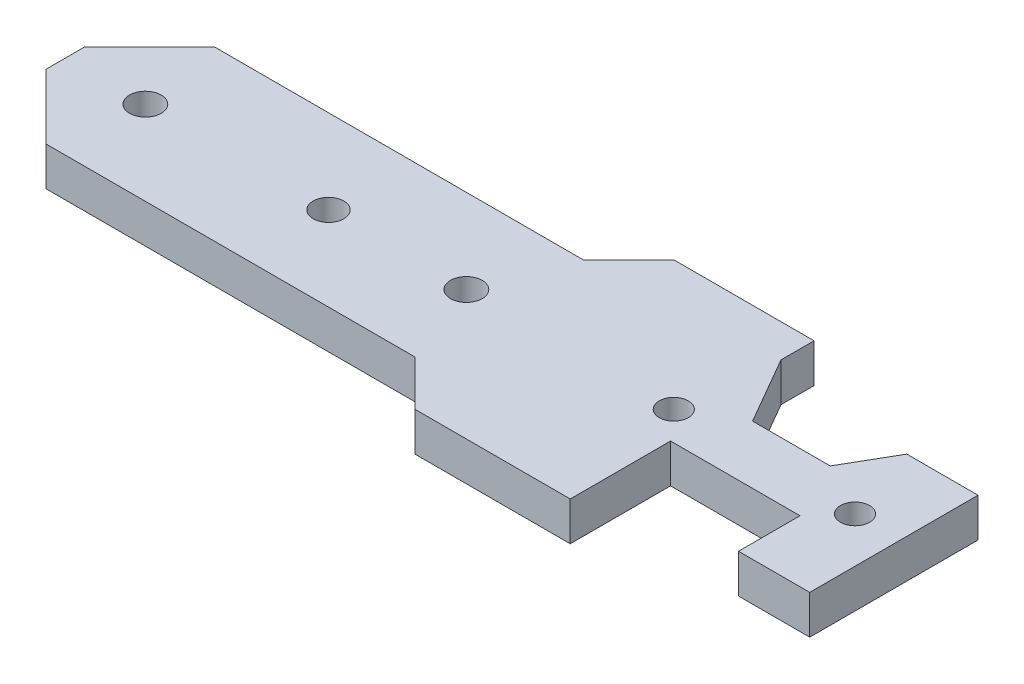
ISO-10303-21;
HEADER;
FILE_DESCRIPTION(('STEP AP214'),'2;1');
FILE_NAME('part.step','',(''),(''),'','','');
FILE_SCHEMA(('AUTOMOTIVE_DESIGN { 1 0 10303 214 1 1 1 1 }'));
ENDSEC;
DATA;
#1=APPLICATION_CONTEXT('core data for automotive mechanical design processes');
#2=APPLICATION_PROTOCOL_DEFINITION('international standard','automotive_design',2000,#1);
#3=PRODUCT_CONTEXT('',#1,'mechanical');
#4=PRODUCT('Part','Part','',(#3));
#5=PRODUCT_RELATED_PRODUCT_CATEGORY('part','',(#4));
#6=PRODUCT_DEFINITION_FORMATION('','',#4);
#7=PRODUCT_DEFINITION_CONTEXT('part definition',#1,'design');
#8=PRODUCT_DEFINITION('design','',#6,#7);
#9=PRODUCT_DEFINITION_SHAPE('','',#8);
#10=(LENGTH_UNIT() NAMED_UNIT(*) SI_UNIT(.MILLI.,.METRE.));
#11=(NAMED_UNIT(*) PLANE_ANGLE_UNIT() SI_UNIT($,.RADIAN.));
#12=(NAMED_UNIT(*) SI_UNIT($,.STERADIAN.) SOLID_ANGLE_UNIT());
#13=UNCERTAINTY_MEASURE_WITH_UNIT(LENGTH_MEASURE(1.E-05),#10,'distance_accuracy_value','');
#14=(GEOMETRIC_REPRESENTATION_CONTEXT(3) GLOBAL_UNCERTAINTY_ASSIGNED_CONTEXT((#13)) GLOBAL_UNIT_ASSIGNED_CONTEXT((#10,
#11,#12)) REPRESENTATION_CONTEXT('',''));
#15=CARTESIAN_POINT('',(0.,0.,0.));
#16=DIRECTION('',(0.,0.,1.));
#17=DIRECTION('',(1.,0.,0.));
#18=AXIS2_PLACEMENT_3D('',#15,#16,#17);
#19=CARTESIAN_POINT('',(67.,6.,13.));
#20=DIRECTION('',(0.707106781186547,0.,-0.707106781186548));
#21=DIRECTION('',(-0.707106781186548,0.,-0.707106781186547));
#22=AXIS2_PLACEMENT_3D('',#19,#20,#21);
#23=PLANE('',#22);
#24=DIRECTION('',(0.707106781186548,0.,0.707106781186547));
#25=VECTOR('',#24,1.);
#26=CARTESIAN_POINT('',(67.,0.,13.));
#27=LINE('',#26,#25);
#28=CARTESIAN_POINT('',(67.,0.,13.));
#29=VERTEX_POINT('',#28);
#30=CARTESIAN_POINT('',(74.,0.,20.));
#31=VERTEX_POINT('',#30);
#32=EDGE_CURVE('E292',#29,#31,#27,.T.);
#33=ORIENTED_EDGE('',*,*,#32,.T.);
#34=DIRECTION('',(0.,-1.,0.));
#35=VECTOR('',#34,1.);
#36=CARTESIAN_POINT('',(74.,6.,20.));
#37=LINE('',#36,#35);
#38=CARTESIAN_POINT('',(74.,6.,20.));
#39=VERTEX_POINT('',#38);
#40=EDGE_CURVE('E12',#39,#31,#37,.T.);
#41=ORIENTED_EDGE('',*,*,#40,.F.);
#42=DIRECTION('',(0.707106781186548,0.,0.707106781186547));
#43=VECTOR('',#42,1.);
#44=CARTESIAN_POINT('',(67.,6.,13.));
#45=LINE('',#44,#43);
#46=CARTESIAN_POINT('',(67.,6.,13.));
#47=VERTEX_POINT('',#46);
#48=EDGE_CURVE('E276',#47,#39,#45,.T.);
#49=ORIENTED_EDGE('',*,*,#48,.F.);
#50=DIRECTION('',(0.,-1.,0.));
#51=VECTOR('',#50,1.);
#52=CARTESIAN_POINT('',(67.,6.,13.));
#53=LINE('',#52,#51);
#54=EDGE_CURVE('E199',#47,#29,#53,.T.);
#55=ORIENTED_EDGE('',*,*,#54,.T.);
#56=EDGE_LOOP('',(#33,#41,#49,#55));
#57=FACE_BOUND('',#56,.T.);
#58=ADVANCED_FACE('F38',(#57),#23,.F.);
#59=CARTESIAN_POINT('',(74.,6.,20.));
#60=DIRECTION('',(0.,0.,-1.));
#61=DIRECTION('',(-1.,0.,0.));
#62=AXIS2_PLACEMENT_3D('',#59,#60,#61);
#63=PLANE('',#62);
#64=DIRECTION('',(1.,0.,0.));
#65=VECTOR('',#64,1.);
#66=CARTESIAN_POINT('',(74.,0.,20.));
#67=LINE('',#66,#65);
#68=CARTESIAN_POINT('',(98.,0.,20.));
#69=VERTEX_POINT('',#68);
#70=EDGE_CURVE('E374',#31,#69,#67,.T.);
#71=ORIENTED_EDGE('',*,*,#70,.T.);
#72=DIRECTION('',(0.,-1.,0.));
#73=VECTOR('',#72,1.);
#74=CARTESIAN_POINT('',(98.,6.,20.));
#75=LINE('',#74,#73);
#76=CARTESIAN_POINT('',(98.,6.,20.));
#77=VERTEX_POINT('',#76);
#78=EDGE_CURVE('E46',#77,#69,#75,.T.);
#79=ORIENTED_EDGE('',*,*,#78,.F.);
#80=DIRECTION('',(1.,0.,0.));
#81=VECTOR('',#80,1.);
#82=CARTESIAN_POINT('',(74.,6.,20.));
#83=LINE('',#82,#81);
#84=EDGE_CURVE('E130',#39,#77,#83,.T.);
#85=ORIENTED_EDGE('',*,*,#84,.F.);
#86=ORIENTED_EDGE('',*,*,#40,.T.);
#87=EDGE_LOOP('',(#71,#79,#85,#86));
#88=FACE_BOUND('',#87,.T.);
#89=ADVANCED_FACE('F363',(#88),#63,.F.);
#90=CARTESIAN_POINT('',(98.,6.,20.));
#91=DIRECTION('',(-1.,0.,0.));
#92=DIRECTION('',(0.,0.,1.));
#93=AXIS2_PLACEMENT_3D('',#90,#91,#92);
#94=PLANE('',#93);
#95=DIRECTION('',(0.,0.,-1.));
#96=VECTOR('',#95,1.);
#97=CARTESIAN_POINT('',(98.,0.,20.));
#98=LINE('',#97,#96);
#99=CARTESIAN_POINT('',(98.,0.,4.5));
#100=VERTEX_POINT('',#99);
#101=EDGE_CURVE('E375',#69,#100,#98,.T.);
#102=ORIENTED_EDGE('',*,*,#101,.T.);
#103=DIRECTION('',(0.,-1.,0.));
#104=VECTOR('',#103,1.);
#105=CARTESIAN_POINT('',(98.,6.,4.5));
#106=LINE('',#105,#104);
#107=CARTESIAN_POINT('',(98.,6.,4.5));
#108=VERTEX_POINT('',#107);
#109=EDGE_CURVE('E447',#108,#100,#106,.T.);
#110=ORIENTED_EDGE('',*,*,#109,.F.);
#111=DIRECTION('',(0.,0.,-1.));
#112=VECTOR('',#111,1.);
#113=CARTESIAN_POINT('',(98.,6.,20.));
#114=LINE('',#113,#112);
#115=EDGE_CURVE('E269',#77,#108,#114,.T.);
#116=ORIENTED_EDGE('',*,*,#115,.F.);
#117=ORIENTED_EDGE('',*,*,#78,.T.);
#118=EDGE_LOOP('',(#102,#110,#116,#117));
#119=FACE_BOUND('',#118,.T.);
#120=ADVANCED_FACE('F368',(#119),#94,.F.);
#121=CARTESIAN_POINT('',(98.,6.,4.5));
#122=DIRECTION('',(0.,0.,-1.));
#123=DIRECTION('',(-1.,0.,0.));
#124=AXIS2_PLACEMENT_3D('',#121,#122,#123);
#125=PLANE('',#124);
#126=DIRECTION('',(1.,0.,0.));
#127=VECTOR('',#126,1.);
#128=CARTESIAN_POINT('',(98.,0.,4.5));
#129=LINE('',#128,#127);
#130=CARTESIAN_POINT('',(118.,0.,4.5));
#131=VERTEX_POINT('',#130);
#132=EDGE_CURVE('E379',#100,#131,#129,.T.);
#133=ORIENTED_EDGE('',*,*,#132,.T.);
#134=DIRECTION('',(0.,-1.,0.));
#135=VECTOR('',#134,1.);
#136=CARTESIAN_POINT('',(118.,6.,4.5));
#137=LINE('',#136,#135);
#138=CARTESIAN_POINT('',(118.,6.,4.5));
#139=VERTEX_POINT('',#138);
#140=EDGE_CURVE('E444',#139,#131,#137,.T.);
#141=ORIENTED_EDGE('',*,*,#140,.F.);
#142=DIRECTION('',(1.,0.,0.));
#143=VECTOR('',#142,1.);
#144=CARTESIAN_POINT('',(98.,6.,4.5));
#145=LINE('',#144,#143);
#146=EDGE_CURVE('E266',#108,#139,#145,.T.);
#147=ORIENTED_EDGE('',*,*,#146,.F.);
#148=ORIENTED_EDGE('',*,*,#109,.T.);
#149=EDGE_LOOP('',(#133,#141,#147,#148));
#150=FACE_BOUND('',#149,.T.);
#151=ADVANCED_FACE('F459',(#150),#125,.F.);
#152=CARTESIAN_POINT('',(118.,6.,4.5));
#153=DIRECTION('',(1.,0.,0.));
#154=DIRECTION('',(0.,0.,-1.));
#155=AXIS2_PLACEMENT_3D('',#152,#153,#154);
#156=PLANE('',#155);
#157=DIRECTION('',(0.,0.,1.));
#158=VECTOR('',#157,1.);
#159=CARTESIAN_POINT('',(118.,0.,4.5));
#160=LINE('',#159,#158);
#161=CARTESIAN_POINT('',(118.,0.,14.));
#162=VERTEX_POINT('',#161);
#163=EDGE_CURVE('E381',#131,#162,#160,.T.);
#164=ORIENTED_EDGE('',*,*,#163,.T.);
#165=DIRECTION('',(0.,-1.,0.));
#166=VECTOR('',#165,1.);
#167=CARTESIAN_POINT('',(118.,6.,14.));
#168=LINE('',#167,#166);
#169=CARTESIAN_POINT('',(118.,6.,14.));
#170=VERTEX_POINT('',#169);
#171=EDGE_CURVE('E441',#170,#162,#168,.T.);
#172=ORIENTED_EDGE('',*,*,#171,.F.);
#173=DIRECTION('',(0.,0.,1.));
#174=VECTOR('',#173,1.);
#175=CARTESIAN_POINT('',(118.,6.,4.5));
#176=LINE('',#175,#174);
#177=EDGE_CURVE('E258',#139,#170,#176,.T.);
#178=ORIENTED_EDGE('',*,*,#177,.F.);
#179=ORIENTED_EDGE('',*,*,#140,.T.);
#180=EDGE_LOOP('',(#164,#172,#178,#179));
#181=FACE_BOUND('',#180,.T.);
#182=ADVANCED_FACE('F463',(#181),#156,.F.);
#183=CARTESIAN_POINT('',(118.,6.,14.));
#184=DIRECTION('',(0.,0.,-1.));
#185=DIRECTION('',(-1.,0.,0.));
#186=AXIS2_PLACEMENT_3D('',#183,#184,#185);
#187=PLANE('',#186);
#188=DIRECTION('',(1.,0.,0.));
#189=VECTOR('',#188,1.);
#190=CARTESIAN_POINT('',(118.,0.,14.));
#191=LINE('',#190,#189);
#192=CARTESIAN_POINT('',(129.,0.,14.));
#193=VERTEX_POINT('',#192);
#194=EDGE_CURVE('E383',#162,#193,#191,.T.);
#195=ORIENTED_EDGE('',*,*,#194,.T.);
#196=DIRECTION('',(0.,-1.,0.));
#197=VECTOR('',#196,1.);
#198=CARTESIAN_POINT('',(129.,6.,14.));
#199=LINE('',#198,#197);
#200=CARTESIAN_POINT('',(129.,6.,14.));
#201=VERTEX_POINT('',#200);
#202=EDGE_CURVE('E438',#201,#193,#199,.T.);
#203=ORIENTED_EDGE('',*,*,#202,.F.);
#204=DIRECTION('',(1.,0.,0.));
#205=VECTOR('',#204,1.);
#206=CARTESIAN_POINT('',(118.,6.,14.));
#207=LINE('',#206,#205);
#208=EDGE_CURVE('E254',#170,#201,#207,.T.);
#209=ORIENTED_EDGE('',*,*,#208,.F.);
#210=ORIENTED_EDGE('',*,*,#171,.T.);
#211=EDGE_LOOP('',(#195,#203,#209,#210));
#212=FACE_BOUND('',#211,.T.);
#213=ADVANCED_FACE('F519',(#212),#187,.F.);
#214=CARTESIAN_POINT('',(129.,6.,14.));
#215=DIRECTION('',(-1.,0.,0.));
#216=DIRECTION('',(0.,0.,1.));
#217=AXIS2_PLACEMENT_3D('',#214,#215,#216);
#218=PLANE('',#217);
#219=DIRECTION('',(0.,0.,-1.));
#220=VECTOR('',#219,1.);
#221=CARTESIAN_POINT('',(129.,0.,14.));
#222=LINE('',#221,#220);
#223=CARTESIAN_POINT('',(129.,0.,-12.));
#224=VERTEX_POINT('',#223);
#225=EDGE_CURVE('E385',#193,#224,#222,.T.);
#226=ORIENTED_EDGE('',*,*,#225,.T.);
#227=DIRECTION('',(0.,-1.,0.));
#228=VECTOR('',#227,1.);
#229=CARTESIAN_POINT('',(129.,6.,-12.));
#230=LINE('',#229,#228);
#231=CARTESIAN_POINT('',(129.,6.,-12.));
#232=VERTEX_POINT('',#231);
#233=EDGE_CURVE('E435',#232,#224,#230,.T.);
#234=ORIENTED_EDGE('',*,*,#233,.F.);
#235=DIRECTION('',(0.,0.,-1.));
#236=VECTOR('',#235,1.);
#237=CARTESIAN_POINT('',(129.,6.,14.));
#238=LINE('',#237,#236);
#239=EDGE_CURVE('E250',#201,#232,#238,.T.);
#240=ORIENTED_EDGE('',*,*,#239,.F.);
#241=ORIENTED_EDGE('',*,*,#202,.T.);
#242=EDGE_LOOP('',(#226,#234,#240,#241));
#243=FACE_BOUND('',#242,.T.);
#244=ADVANCED_FACE('F516',(#243),#218,.F.);
#245=CARTESIAN_POINT('',(129.,6.,-12.));
#246=DIRECTION('',(0.,0.,1.));
#247=DIRECTION('',(1.,0.,0.));
#248=AXIS2_PLACEMENT_3D('',#245,#246,#247);
#249=PLANE('',#248);
#250=DIRECTION('',(-1.,0.,0.));
#251=VECTOR('',#250,1.);
#252=CARTESIAN_POINT('',(129.,0.,-12.));
#253=LINE('',#252,#251);
#254=CARTESIAN_POINT('',(118.,0.,-12.));
#255=VERTEX_POINT('',#254);
#256=EDGE_CURVE('E387',#224,#255,#253,.T.);
#257=ORIENTED_EDGE('',*,*,#256,.T.);
#258=DIRECTION('',(0.,-1.,0.));
#259=VECTOR('',#258,1.);
#260=CARTESIAN_POINT('',(118.,6.,-12.));
#261=LINE('',#260,#259);
#262=CARTESIAN_POINT('',(118.,6.,-12.));
#263=VERTEX_POINT('',#262);
#264=EDGE_CURVE('E432',#263,#255,#261,.T.);
#265=ORIENTED_EDGE('',*,*,#264,.F.);
#266=DIRECTION('',(-1.,0.,0.));
#267=VECTOR('',#266,1.);
#268=CARTESIAN_POINT('',(129.,6.,-12.));
#269=LINE('',#268,#267);
#270=EDGE_CURVE('E247',#232,#263,#269,.T.);
#271=ORIENTED_EDGE('',*,*,#270,.F.);
#272=ORIENTED_EDGE('',*,*,#233,.T.);
#273=EDGE_LOOP('',(#257,#265,#271,#272));
#274=FACE_BOUND('',#273,.T.);
#275=ADVANCED_FACE('F512',(#274),#249,.F.);
#276=CARTESIAN_POINT('',(118.,6.,-12.));
#277=DIRECTION('',(0.86602540378444,0.,0.499999999999998));
#278=DIRECTION('',(0.499999999999998,0.,-0.86602540378444));
#279=AXIS2_PLACEMENT_3D('',#276,#277,#278);
#280=PLANE('',#279);
#281=DIRECTION('',(-0.499999999999998,0.,0.86602540378444));
#282=VECTOR('',#281,1.);
#283=CARTESIAN_POINT('',(118.,0.,-12.));
#284=LINE('',#283,#282);
#285=CARTESIAN_POINT('',(113.669872981078,0.,-4.49999999999999));
#286=VERTEX_POINT('',#285);
#287=EDGE_CURVE('E389',#255,#286,#284,.T.);
#288=ORIENTED_EDGE('',*,*,#287,.T.);
#289=DIRECTION('',(0.,-1.,0.));
#290=VECTOR('',#289,1.);
#291=CARTESIAN_POINT('',(113.669872981078,6.,-4.49999999999999));
#292=LINE('',#291,#290);
#293=CARTESIAN_POINT('',(113.669872981078,6.,-4.49999999999999));
#294=VERTEX_POINT('',#293);
#295=EDGE_CURVE('E429',#294,#286,#292,.T.);
#296=ORIENTED_EDGE('',*,*,#295,.F.);
#297=DIRECTION('',(-0.499999999999998,0.,0.86602540378444));
#298=VECTOR('',#297,1.);
#299=CARTESIAN_POINT('',(118.,6.,-12.));
#300=LINE('',#299,#298);
#301=EDGE_CURVE('E239',#263,#294,#300,.T.);
#302=ORIENTED_EDGE('',*,*,#301,.F.);
#303=ORIENTED_EDGE('',*,*,#264,.T.);
#304=EDGE_LOOP('',(#288,#296,#302,#303));
#305=FACE_BOUND('',#304,.T.);
#306=ADVANCED_FACE('F507',(#305),#280,.F.);
#307=CARTESIAN_POINT('',(113.669872981078,6.,-4.49999999999999));
#308=DIRECTION('',(0.,0.,1.));
#309=DIRECTION('',(1.,0.,0.));
#310=AXIS2_PLACEMENT_3D('',#307,#308,#309);
#311=PLANE('',#310);
#312=DIRECTION('',(-1.,0.,0.));
#313=VECTOR('',#312,1.);
#314=CARTESIAN_POINT('',(113.669872981078,0.,-4.49999999999999));
#315=LINE('',#314,#313);
#316=CARTESIAN_POINT('',(101.669872981078,0.,-4.49999999999999));
#317=VERTEX_POINT('',#316);
#318=EDGE_CURVE('E391',#286,#317,#315,.T.);
#319=ORIENTED_EDGE('',*,*,#318,.T.);
#320=DIRECTION('',(0.,-1.,0.));
#321=VECTOR('',#320,1.);
#322=CARTESIAN_POINT('',(101.669872981078,6.,-4.49999999999999));
#323=LINE('',#322,#321);
#324=CARTESIAN_POINT('',(101.669872981078,6.,-4.49999999999999));
#325=VERTEX_POINT('',#324);
#326=EDGE_CURVE('E426',#325,#317,#323,.T.);
#327=ORIENTED_EDGE('',*,*,#326,.F.);
#328=DIRECTION('',(-1.,0.,0.));
#329=VECTOR('',#328,1.);
#330=CARTESIAN_POINT('',(113.669872981078,6.,-4.49999999999999));
#331=LINE('',#330,#329);
#332=EDGE_CURVE('E235',#294,#325,#331,.T.);
#333=ORIENTED_EDGE('',*,*,#332,.F.);
#334=ORIENTED_EDGE('',*,*,#295,.T.);
#335=EDGE_LOOP('',(#319,#327,#333,#334));
#336=FACE_BOUND('',#335,.T.);
#337=ADVANCED_FACE('F501',(#336),#311,.F.);
#338=CARTESIAN_POINT('',(101.669872981078,6.,-4.49999999999999));
#339=DIRECTION('',(-0.86602540378444,0.,0.499999999999997));
#340=DIRECTION('',(0.499999999999997,0.,0.86602540378444));
#341=AXIS2_PLACEMENT_3D('',#338,#339,#340);
#342=PLANE('',#341);
#343=DIRECTION('',(-0.499999999999997,0.,-0.86602540378444));
#344=VECTOR('',#343,1.);
#345=CARTESIAN_POINT('',(101.669872981078,0.,-4.49999999999999));
#346=LINE('',#345,#344);
#347=CARTESIAN_POINT('',(95.6698729810779,0.,-14.8923048454133));
#348=VERTEX_POINT('',#347);
#349=EDGE_CURVE('E393',#317,#348,#346,.T.);
#350=ORIENTED_EDGE('',*,*,#349,.T.);
#351=DIRECTION('',(0.,-1.,0.));
#352=VECTOR('',#351,1.);
#353=CARTESIAN_POINT('',(95.6698729810779,6.,-14.8923048454133));
#354=LINE('',#353,#352);
#355=CARTESIAN_POINT('',(95.6698729810779,6.,-14.8923048454133));
#356=VERTEX_POINT('',#355);
#357=EDGE_CURVE('E423',#356,#348,#354,.T.);
#358=ORIENTED_EDGE('',*,*,#357,.F.);
#359=DIRECTION('',(-0.499999999999997,0.,-0.86602540378444));
#360=VECTOR('',#359,1.);
#361=CARTESIAN_POINT('',(101.669872981078,6.,-4.49999999999999));
#362=LINE('',#361,#360);
#363=EDGE_CURVE('E231',#325,#356,#362,.T.);
#364=ORIENTED_EDGE('',*,*,#363,.F.);
#365=ORIENTED_EDGE('',*,*,#326,.T.);
#366=EDGE_LOOP('',(#350,#358,#364,#365));
#367=FACE_BOUND('',#366,.T.);
#368=ADVANCED_FACE('F497',(#367),#342,.F.);
#369=CARTESIAN_POINT('',(95.6698729810779,6.,-14.8923048454133));
#370=DIRECTION('',(-1.,0.,0.));
#371=DIRECTION('',(0.,0.,1.));
#372=AXIS2_PLACEMENT_3D('',#369,#370,#371);
#373=PLANE('',#372);
#374=DIRECTION('',(0.,0.,-1.));
#375=VECTOR('',#374,1.);
#376=CARTESIAN_POINT('',(95.6698729810779,0.,-14.8923048454133));
#377=LINE('',#376,#375);
#378=CARTESIAN_POINT('',(95.6698729810779,0.,-20.));
#379=VERTEX_POINT('',#378);
#380=EDGE_CURVE('E395',#348,#379,#377,.T.);
#381=ORIENTED_EDGE('',*,*,#380,.T.);
#382=DIRECTION('',(0.,-1.,0.));
#383=VECTOR('',#382,1.);
#384=CARTESIAN_POINT('',(95.6698729810779,6.,-20.));
#385=LINE('',#384,#383);
#386=CARTESIAN_POINT('',(95.6698729810779,6.,-20.));
#387=VERTEX_POINT('',#386);
#388=EDGE_CURVE('E420',#387,#379,#385,.T.);
#389=ORIENTED_EDGE('',*,*,#388,.F.);
#390=DIRECTION('',(0.,0.,-1.));
#391=VECTOR('',#390,1.);
#392=CARTESIAN_POINT('',(95.6698729810779,6.,-14.8923048454133));
#393=LINE('',#392,#391);
#394=EDGE_CURVE('E228',#356,#387,#393,.T.);
#395=ORIENTED_EDGE('',*,*,#394,.F.);
#396=ORIENTED_EDGE('',*,*,#357,.T.);
#397=EDGE_LOOP('',(#381,#389,#395,#396));
#398=FACE_BOUND('',#397,.T.);
#399=ADVANCED_FACE('F493',(#398),#373,.F.);
#400=CARTESIAN_POINT('',(74.,6.,-20.));
#401=DIRECTION('',(0.,0.,1.));
#402=DIRECTION('',(1.,0.,0.));
#403=AXIS2_PLACEMENT_3D('',#400,#401,#402);
#404=PLANE('',#403);
#405=DIRECTION('',(-1.,0.,0.));
#406=VECTOR('',#405,1.);
#407=CARTESIAN_POINT('',(74.,0.,-20.));
#408=LINE('',#407,#406);
#409=CARTESIAN_POINT('',(74.,0.,-20.));
#410=VERTEX_POINT('',#409);
#411=EDGE_CURVE('E397',#379,#410,#408,.T.);
#412=ORIENTED_EDGE('',*,*,#411,.T.);
#413=DIRECTION('',(0.,-1.,0.));
#414=VECTOR('',#413,1.);
#415=CARTESIAN_POINT('',(74.,6.,-20.));
#416=LINE('',#415,#414);
#417=CARTESIAN_POINT('',(74.,6.,-20.));
#418=VERTEX_POINT('',#417);
#419=EDGE_CURVE('E417',#418,#410,#416,.T.);
#420=ORIENTED_EDGE('',*,*,#419,.F.);
#421=DIRECTION('',(-1.,0.,0.));
#422=VECTOR('',#421,1.);
#423=CARTESIAN_POINT('',(74.,6.,-20.));
#424=LINE('',#423,#422);
#425=EDGE_CURVE('E220',#387,#418,#424,.T.);
#426=ORIENTED_EDGE('',*,*,#425,.F.);
#427=ORIENTED_EDGE('',*,*,#388,.T.);
#428=EDGE_LOOP('',(#412,#420,#426,#427));
#429=FACE_BOUND('',#428,.T.);
#430=ADVANCED_FACE('F476',(#429),#404,.F.);
#431=CARTESIAN_POINT('',(74.,6.,-20.));
#432=DIRECTION('',(0.707106781186548,0.,0.707106781186547));
#433=DIRECTION('',(0.707106781186547,0.,-0.707106781186548));
#434=AXIS2_PLACEMENT_3D('',#431,#432,#433);
#435=PLANE('',#434);
#436=DIRECTION('',(-0.707106781186547,0.,0.707106781186548));
#437=VECTOR('',#436,1.);
#438=CARTESIAN_POINT('',(74.,0.,-20.));
#439=LINE('',#438,#437);
#440=CARTESIAN_POINT('',(67.,0.,-13.));
#441=VERTEX_POINT('',#440);
#442=EDGE_CURVE('E399',#410,#441,#439,.T.);
#443=ORIENTED_EDGE('',*,*,#442,.T.);
#444=DIRECTION('',(0.,-1.,0.));
#445=VECTOR('',#444,1.);
#446=CARTESIAN_POINT('',(67.,6.,-13.));
#447=LINE('',#446,#445);
#448=CARTESIAN_POINT('',(67.,6.,-13.));
#449=VERTEX_POINT('',#448);
#450=EDGE_CURVE('E414',#449,#441,#447,.T.);
#451=ORIENTED_EDGE('',*,*,#450,.F.);
#452=DIRECTION('',(-0.707106781186547,0.,0.707106781186548));
#453=VECTOR('',#452,1.);
#454=CARTESIAN_POINT('',(74.,6.,-20.));
#455=LINE('',#454,#453);
#456=EDGE_CURVE('E216',#418,#449,#455,.T.);
#457=ORIENTED_EDGE('',*,*,#456,.F.);
#458=ORIENTED_EDGE('',*,*,#419,.T.);
#459=EDGE_LOOP('',(#443,#451,#457,#458));
#460=FACE_BOUND('',#459,.T.);
#461=ADVANCED_FACE('F480',(#460),#435,.F.);
#462=CARTESIAN_POINT('',(9.99999999999999,6.,-13.));
#463=DIRECTION('',(0.,0.,1.));
#464=DIRECTION('',(1.,0.,0.));
#465=AXIS2_PLACEMENT_3D('',#462,#463,#464);
#466=PLANE('',#465);
#467=DIRECTION('',(-1.,0.,0.));
#468=VECTOR('',#467,1.);
#469=CARTESIAN_POINT('',(9.99999999999999,0.,-13.));
#470=LINE('',#469,#468);
#471=CARTESIAN_POINT('',(9.99999999999999,0.,-13.));
#472=VERTEX_POINT('',#471);
#473=EDGE_CURVE('E401',#441,#472,#470,.T.);
#474=ORIENTED_EDGE('',*,*,#473,.T.);
#475=DIRECTION('',(0.,-1.,0.));
#476=VECTOR('',#475,1.);
#477=CARTESIAN_POINT('',(9.99999999999999,6.,-13.));
#478=LINE('',#477,#476);
#479=CARTESIAN_POINT('',(9.99999999999999,6.,-13.));
#480=VERTEX_POINT('',#479);
#481=EDGE_CURVE('E411',#480,#472,#478,.T.);
#482=ORIENTED_EDGE('',*,*,#481,.F.);
#483=DIRECTION('',(-1.,0.,0.));
#484=VECTOR('',#483,1.);
#485=CARTESIAN_POINT('',(9.99999999999999,6.,-13.));
#486=LINE('',#485,#484);
#487=EDGE_CURVE('E212',#449,#480,#486,.T.);
#488=ORIENTED_EDGE('',*,*,#487,.F.);
#489=ORIENTED_EDGE('',*,*,#450,.T.);
#490=EDGE_LOOP('',(#474,#482,#488,#489));
#491=FACE_BOUND('',#490,.T.);
#492=ADVANCED_FACE('F485',(#491),#466,.F.);
#493=CARTESIAN_POINT('',(0.,6.,-3.));
#494=DIRECTION('',(0.707106781186549,0.,0.707106781186546));
#495=DIRECTION('',(0.707106781186546,0.,-0.707106781186549));
#496=AXIS2_PLACEMENT_3D('',#493,#494,#495);
#497=PLANE('',#496);
#498=DIRECTION('',(-0.707106781186546,0.,0.707106781186549));
#499=VECTOR('',#498,1.);
#500=CARTESIAN_POINT('',(0.,0.,-3.));
#501=LINE('',#500,#499);
#502=CARTESIAN_POINT('',(0.,0.,-3.));
#503=VERTEX_POINT('',#502);
#504=EDGE_CURVE('E403',#472,#503,#501,.T.);
#505=ORIENTED_EDGE('',*,*,#504,.T.);
#506=DIRECTION('',(0.,-1.,0.));
#507=VECTOR('',#506,1.);
#508=CARTESIAN_POINT('',(0.,6.,-3.));
#509=LINE('',#508,#507);
#510=CARTESIAN_POINT('',(0.,6.,-3.));
#511=VERTEX_POINT('',#510);
#512=EDGE_CURVE('E192',#511,#503,#509,.T.);
#513=ORIENTED_EDGE('',*,*,#512,.F.);
#514=DIRECTION('',(-0.707106781186546,0.,0.707106781186549));
#515=VECTOR('',#514,1.);
#516=CARTESIAN_POINT('',(0.,6.,-3.));
#517=LINE('',#516,#515);
#518=EDGE_CURVE('E182',#480,#511,#517,.T.);
#519=ORIENTED_EDGE('',*,*,#518,.F.);
#520=ORIENTED_EDGE('',*,*,#481,.T.);
#521=EDGE_LOOP('',(#505,#513,#519,#520));
#522=FACE_BOUND('',#521,.T.);
#523=ADVANCED_FACE('F488',(#522),#497,.F.);
#524=CARTESIAN_POINT('',(0.,6.,-3.));
#525=DIRECTION('',(1.,0.,0.));
#526=DIRECTION('',(0.,0.,-1.));
#527=AXIS2_PLACEMENT_3D('',#524,#525,#526);
#528=PLANE('',#527);
#529=DIRECTION('',(0.,0.,1.));
#530=VECTOR('',#529,1.);
#531=CARTESIAN_POINT('',(0.,0.,-3.));
#532=LINE('',#531,#530);
#533=CARTESIAN_POINT('',(0.,0.,3.));
#534=VERTEX_POINT('',#533);
#535=EDGE_CURVE('E191',#503,#534,#532,.T.);
#536=ORIENTED_EDGE('',*,*,#535,.T.);
#537=DIRECTION('',(0.,-1.,0.));
#538=VECTOR('',#537,1.);
#539=CARTESIAN_POINT('',(0.,6.,3.));
#540=LINE('',#539,#538);
#541=CARTESIAN_POINT('',(0.,6.,3.));
#542=VERTEX_POINT('',#541);
#543=EDGE_CURVE('E188',#542,#534,#540,.T.);
#544=ORIENTED_EDGE('',*,*,#543,.F.);
#545=DIRECTION('',(0.,0.,1.));
#546=VECTOR('',#545,1.);
#547=CARTESIAN_POINT('',(0.,6.,-3.));
#548=LINE('',#547,#546);
#549=EDGE_CURVE('E176',#511,#542,#548,.T.);
#550=ORIENTED_EDGE('',*,*,#549,.F.);
#551=ORIENTED_EDGE('',*,*,#512,.T.);
#552=EDGE_LOOP('',(#536,#544,#550,#551));
#553=FACE_BOUND('',#552,.T.);
#554=ADVANCED_FACE('F189',(#553),#528,.F.);
#555=CARTESIAN_POINT('',(0.,6.,3.));
#556=DIRECTION('',(0.707106781186548,0.,-0.707106781186547));
#557=DIRECTION('',(-0.707106781186547,0.,-0.707106781186548));
#558=AXIS2_PLACEMENT_3D('',#555,#556,#557);
#559=PLANE('',#558);
#560=DIRECTION('',(0.707106781186547,0.,0.707106781186548));
#561=VECTOR('',#560,1.);
#562=CARTESIAN_POINT('',(0.,0.,3.));
#563=LINE('',#562,#561);
#564=CARTESIAN_POINT('',(9.99999999999999,0.,13.));
#565=VERTEX_POINT('',#564);
#566=EDGE_CURVE('E116',#534,#565,#563,.T.);
#567=ORIENTED_EDGE('',*,*,#566,.T.);
#568=DIRECTION('',(0.,-1.,0.));
#569=VECTOR('',#568,1.);
#570=CARTESIAN_POINT('',(9.99999999999999,6.,13.));
#571=LINE('',#570,#569);
#572=CARTESIAN_POINT('',(9.99999999999999,6.,13.));
#573=VERTEX_POINT('',#572);
#574=EDGE_CURVE('E193',#573,#565,#571,.T.);
#575=ORIENTED_EDGE('',*,*,#574,.F.);
#576=DIRECTION('',(0.707106781186547,0.,0.707106781186548));
#577=VECTOR('',#576,1.);
#578=CARTESIAN_POINT('',(0.,6.,3.));
#579=LINE('',#578,#577);
#580=EDGE_CURVE('E180',#542,#573,#579,.T.);
#581=ORIENTED_EDGE('',*,*,#580,.F.);
#582=ORIENTED_EDGE('',*,*,#543,.T.);
#583=EDGE_LOOP('',(#567,#575,#581,#582));
#584=FACE_BOUND('',#583,.T.);
#585=ADVANCED_FACE('F195',(#584),#559,.F.);
#586=CARTESIAN_POINT('',(9.99999999999999,6.,13.));
#587=DIRECTION('',(0.,0.,-1.));
#588=DIRECTION('',(-1.,0.,0.));
#589=AXIS2_PLACEMENT_3D('',#586,#587,#588);
#590=PLANE('',#589);
#591=DIRECTION('',(1.,0.,0.));
#592=VECTOR('',#591,1.);
#593=CARTESIAN_POINT('',(9.99999999999999,0.,13.));
#594=LINE('',#593,#592);
#595=EDGE_CURVE('E122',#565,#29,#594,.T.);
#596=ORIENTED_EDGE('',*,*,#595,.T.);
#597=ORIENTED_EDGE('',*,*,#54,.F.);
#598=DIRECTION('',(1.,0.,0.));
#599=VECTOR('',#598,1.);
#600=CARTESIAN_POINT('',(9.99999999999999,6.,13.));
#601=LINE('',#600,#599);
#602=EDGE_CURVE('E54',#573,#47,#601,.T.);
#603=ORIENTED_EDGE('',*,*,#602,.F.);
#604=ORIENTED_EDGE('',*,*,#574,.T.);
#605=EDGE_LOOP('',(#596,#597,#603,#604));
#606=FACE_BOUND('',#605,.T.);
#607=ADVANCED_FACE('F338',(#606),#590,.F.);
#608=CARTESIAN_POINT('',(54.,6.,0.));
#609=DIRECTION('',(0.,-1.,0.));
#610=DIRECTION('',(0.,0.,-1.));
#611=AXIS2_PLACEMENT_3D('',#608,#609,#610);
#612=PLANE('',#611);
#613=CARTESIAN_POINT('',(122.,6.,0.));
#614=DIRECTION('',(0.,1.,0.));
#615=DIRECTION('',(0.,0.,1.));
#616=AXIS2_PLACEMENT_3D('',#613,#614,#615);
#617=CIRCLE('',#616,2.24999999999999);
#618=CARTESIAN_POINT('',(122.,6.,2.24999999999999));
#619=VERTEX_POINT('',#618);
#620=EDGE_CURVE('E318',#619,#619,#617,.T.);
#621=ORIENTED_EDGE('',*,*,#620,.F.);
#622=EDGE_LOOP('',(#621));
#623=FACE_BOUND('',#622,.T.);
#624=CARTESIAN_POINT('',(94.,6.,0.));
#625=DIRECTION('',(0.,1.,0.));
#626=DIRECTION('',(0.,0.,1.));
#627=AXIS2_PLACEMENT_3D('',#624,#625,#626);
#628=CIRCLE('',#627,2.25);
#629=CARTESIAN_POINT('',(94.,6.,2.25));
#630=VERTEX_POINT('',#629);
#631=EDGE_CURVE('E311',#630,#630,#628,.T.);
#632=ORIENTED_EDGE('',*,*,#631,.F.);
#633=EDGE_LOOP('',(#632));
#634=FACE_BOUND('',#633,.T.);
#635=CARTESIAN_POINT('',(61.95,6.,0.));
#636=DIRECTION('',(0.,1.,0.));
#637=DIRECTION('',(0.,0.,1.));
#638=AXIS2_PLACEMENT_3D('',#635,#636,#637);
#639=CIRCLE('',#638,2.45);
#640=CARTESIAN_POINT('',(61.95,6.,2.45));
#641=VERTEX_POINT('',#640);
#642=EDGE_CURVE('E301',#641,#641,#639,.T.);
#643=ORIENTED_EDGE('',*,*,#642,.F.);
#644=EDGE_LOOP('',(#643));
#645=FACE_BOUND('',#644,.T.);
#646=CARTESIAN_POINT('',(40.65,6.,0.));
#647=DIRECTION('',(0.,1.,0.));
#648=DIRECTION('',(0.,0.,1.));
#649=AXIS2_PLACEMENT_3D('',#646,#647,#648);
#650=CIRCLE('',#649,2.375);
#651=CARTESIAN_POINT('',(40.65,6.,2.375));
#652=VERTEX_POINT('',#651);
#653=EDGE_CURVE('E293',#652,#652,#650,.T.);
#654=ORIENTED_EDGE('',*,*,#653,.F.);
#655=EDGE_LOOP('',(#654));
#656=FACE_BOUND('',#655,.T.);
#657=CARTESIAN_POINT('',(12.35,6.,0.));
#658=DIRECTION('',(0.,1.,0.));
#659=DIRECTION('',(0.,0.,1.));
#660=AXIS2_PLACEMENT_3D('',#657,#658,#659);
#661=CIRCLE('',#660,2.45);
#662=CARTESIAN_POINT('',(12.35,6.,2.45));
#663=VERTEX_POINT('',#662);
#664=EDGE_CURVE('E284',#663,#663,#661,.T.);
#665=ORIENTED_EDGE('',*,*,#664,.F.);
#666=EDGE_LOOP('',(#665));
#667=FACE_BOUND('',#666,.T.);
#668=ORIENTED_EDGE('',*,*,#48,.T.);
#669=ORIENTED_EDGE('',*,*,#84,.T.);
#670=ORIENTED_EDGE('',*,*,#115,.T.);
#671=ORIENTED_EDGE('',*,*,#146,.T.);
#672=ORIENTED_EDGE('',*,*,#177,.T.);
#673=ORIENTED_EDGE('',*,*,#208,.T.);
#674=ORIENTED_EDGE('',*,*,#239,.T.);
#675=ORIENTED_EDGE('',*,*,#270,.T.);
#676=ORIENTED_EDGE('',*,*,#301,.T.);
#677=ORIENTED_EDGE('',*,*,#332,.T.);
#678=ORIENTED_EDGE('',*,*,#363,.T.);
#679=ORIENTED_EDGE('',*,*,#394,.T.);
#680=ORIENTED_EDGE('',*,*,#425,.T.);
#681=ORIENTED_EDGE('',*,*,#456,.T.);
#682=ORIENTED_EDGE('',*,*,#487,.T.);
#683=ORIENTED_EDGE('',*,*,#518,.T.);
#684=ORIENTED_EDGE('',*,*,#549,.T.);
#685=ORIENTED_EDGE('',*,*,#580,.T.);
#686=ORIENTED_EDGE('',*,*,#602,.T.);
#687=EDGE_LOOP('',(#668,#669,#670,#671,#672,#673,#674,#675,#676,#677,#678,#679,#680,#681,#682,
#683,#684,#685,#686));
#688=FACE_BOUND('',#687,.T.);
#689=ADVANCED_FACE('F178',(#623,#634,#645,#656,#667,#688),#612,.F.);
#690=CARTESIAN_POINT('',(54.,0.,0.));
#691=DIRECTION('',(0.,-1.,0.));
#692=DIRECTION('',(0.,0.,-1.));
#693=AXIS2_PLACEMENT_3D('',#690,#691,#692);
#694=PLANE('',#693);
#695=CARTESIAN_POINT('',(122.,0.,0.));
#696=DIRECTION('',(0.,1.,0.));
#697=DIRECTION('',(0.,0.,1.));
#698=AXIS2_PLACEMENT_3D('',#695,#696,#697);
#699=CIRCLE('',#698,2.24999999999999);
#700=CARTESIAN_POINT('',(122.,0.,2.24999999999999));
#701=VERTEX_POINT('',#700);
#702=EDGE_CURVE('E316',#701,#701,#699,.T.);
#703=ORIENTED_EDGE('',*,*,#702,.T.);
#704=EDGE_LOOP('',(#703));
#705=FACE_BOUND('',#704,.T.);
#706=CARTESIAN_POINT('',(94.,0.,0.));
#707=DIRECTION('',(0.,1.,0.));
#708=DIRECTION('',(0.,0.,1.));
#709=AXIS2_PLACEMENT_3D('',#706,#707,#708);
#710=CIRCLE('',#709,2.25);
#711=CARTESIAN_POINT('',(94.,0.,2.25));
#712=VERTEX_POINT('',#711);
#713=EDGE_CURVE('E306',#712,#712,#710,.T.);
#714=ORIENTED_EDGE('',*,*,#713,.T.);
#715=EDGE_LOOP('',(#714));
#716=FACE_BOUND('',#715,.T.);
#717=CARTESIAN_POINT('',(61.95,0.,0.));
#718=DIRECTION('',(0.,1.,0.));
#719=DIRECTION('',(0.,0.,1.));
#720=AXIS2_PLACEMENT_3D('',#717,#718,#719);
#721=CIRCLE('',#720,2.45);
#722=CARTESIAN_POINT('',(61.95,0.,2.45));
#723=VERTEX_POINT('',#722);
#724=EDGE_CURVE('E298',#723,#723,#721,.T.);
#725=ORIENTED_EDGE('',*,*,#724,.T.);
#726=EDGE_LOOP('',(#725));
#727=FACE_BOUND('',#726,.T.);
#728=CARTESIAN_POINT('',(40.65,0.,0.));
#729=DIRECTION('',(0.,1.,0.));
#730=DIRECTION('',(0.,0.,1.));
#731=AXIS2_PLACEMENT_3D('',#728,#729,#730);
#732=CIRCLE('',#731,2.375);
#733=CARTESIAN_POINT('',(40.65,0.,2.375));
#734=VERTEX_POINT('',#733);
#735=EDGE_CURVE('E290',#734,#734,#732,.T.);
#736=ORIENTED_EDGE('',*,*,#735,.T.);
#737=EDGE_LOOP('',(#736));
#738=FACE_BOUND('',#737,.T.);
#739=CARTESIAN_POINT('',(12.35,0.,0.));
#740=DIRECTION('',(0.,1.,0.));
#741=DIRECTION('',(0.,0.,1.));
#742=AXIS2_PLACEMENT_3D('',#739,#740,#741);
#743=CIRCLE('',#742,2.45);
#744=CARTESIAN_POINT('',(12.35,0.,2.45));
#745=VERTEX_POINT('',#744);
#746=EDGE_CURVE('E289',#745,#745,#743,.T.);
#747=ORIENTED_EDGE('',*,*,#746,.T.);
#748=EDGE_LOOP('',(#747));
#749=FACE_BOUND('',#748,.T.);
#750=ORIENTED_EDGE('',*,*,#32,.F.);
#751=ORIENTED_EDGE('',*,*,#595,.F.);
#752=ORIENTED_EDGE('',*,*,#566,.F.);
#753=ORIENTED_EDGE('',*,*,#535,.F.);
#754=ORIENTED_EDGE('',*,*,#504,.F.);
#755=ORIENTED_EDGE('',*,*,#473,.F.);
#756=ORIENTED_EDGE('',*,*,#442,.F.);
#757=ORIENTED_EDGE('',*,*,#411,.F.);
#758=ORIENTED_EDGE('',*,*,#380,.F.);
#759=ORIENTED_EDGE('',*,*,#349,.F.);
#760=ORIENTED_EDGE('',*,*,#318,.F.);
#761=ORIENTED_EDGE('',*,*,#287,.F.);
#762=ORIENTED_EDGE('',*,*,#256,.F.);
#763=ORIENTED_EDGE('',*,*,#225,.F.);
#764=ORIENTED_EDGE('',*,*,#194,.F.);
#765=ORIENTED_EDGE('',*,*,#163,.F.);
#766=ORIENTED_EDGE('',*,*,#132,.F.);
#767=ORIENTED_EDGE('',*,*,#101,.F.);
#768=ORIENTED_EDGE('',*,*,#70,.F.);
#769=EDGE_LOOP('',(#750,#751,#752,#753,#754,#755,#756,#757,#758,#759,#760,#761,#762,#763,#764,
#765,#766,#767,#768));
#770=FACE_BOUND('',#769,.T.);
#771=ADVANCED_FACE('F326',(#705,#716,#727,#738,#749,#770),#694,.T.);
#772=CARTESIAN_POINT('',(12.35,0.,0.));
#773=DIRECTION('',(0.,1.,0.));
#774=DIRECTION('',(0.,0.,1.));
#775=AXIS2_PLACEMENT_3D('',#772,#773,#774);
#776=CYLINDRICAL_SURFACE('',#775,2.45);
#777=ORIENTED_EDGE('',*,*,#746,.F.);
#778=EDGE_LOOP('',(#777));
#779=FACE_BOUND('',#778,.T.);
#780=ORIENTED_EDGE('',*,*,#664,.T.);
#781=EDGE_LOOP('',(#780));
#782=FACE_BOUND('',#781,.T.);
#783=ADVANCED_FACE('F348',(#779,#782),#776,.F.);
#784=CARTESIAN_POINT('',(40.65,0.,0.));
#785=DIRECTION('',(0.,1.,0.));
#786=DIRECTION('',(0.,0.,1.));
#787=AXIS2_PLACEMENT_3D('',#784,#785,#786);
#788=CYLINDRICAL_SURFACE('',#787,2.375);
#789=ORIENTED_EDGE('',*,*,#735,.F.);
#790=EDGE_LOOP('',(#789));
#791=FACE_BOUND('',#790,.T.);
#792=ORIENTED_EDGE('',*,*,#653,.T.);
#793=EDGE_LOOP('',(#792));
#794=FACE_BOUND('',#793,.T.);
#795=ADVANCED_FACE('F350',(#791,#794),#788,.F.);
#796=CARTESIAN_POINT('',(61.95,0.,0.));
#797=DIRECTION('',(0.,1.,0.));
#798=DIRECTION('',(0.,0.,1.));
#799=AXIS2_PLACEMENT_3D('',#796,#797,#798);
#800=CYLINDRICAL_SURFACE('',#799,2.45);
#801=ORIENTED_EDGE('',*,*,#724,.F.);
#802=EDGE_LOOP('',(#801));
#803=FACE_BOUND('',#802,.T.);
#804=ORIENTED_EDGE('',*,*,#642,.T.);
#805=EDGE_LOOP('',(#804));
#806=FACE_BOUND('',#805,.T.);
#807=ADVANCED_FACE('F357',(#803,#806),#800,.F.);
#808=CARTESIAN_POINT('',(94.,0.,0.));
#809=DIRECTION('',(0.,1.,0.));
#810=DIRECTION('',(0.,0.,1.));
#811=AXIS2_PLACEMENT_3D('',#808,#809,#810);
#812=CYLINDRICAL_SURFACE('',#811,2.25);
#813=ORIENTED_EDGE('',*,*,#713,.F.);
#814=EDGE_LOOP('',(#813));
#815=FACE_BOUND('',#814,.T.);
#816=ORIENTED_EDGE('',*,*,#631,.T.);
#817=EDGE_LOOP('',(#816));
#818=FACE_BOUND('',#817,.T.);
#819=ADVANCED_FACE('F332',(#815,#818),#812,.F.);
#820=CARTESIAN_POINT('',(122.,0.,0.));
#821=DIRECTION('',(0.,1.,0.));
#822=DIRECTION('',(0.,0.,1.));
#823=AXIS2_PLACEMENT_3D('',#820,#821,#822);
#824=CYLINDRICAL_SURFACE('',#823,2.24999999999999);
#825=ORIENTED_EDGE('',*,*,#702,.F.);
#826=EDGE_LOOP('',(#825));
#827=FACE_BOUND('',#826,.T.);
#828=ORIENTED_EDGE('',*,*,#620,.T.);
#829=EDGE_LOOP('',(#828));
#830=FACE_BOUND('',#829,.T.);
#831=ADVANCED_FACE('F329',(#827,#830),#824,.F.);
#832=CLOSED_SHELL('',(#58,#89,#120,#151,#182,#213,#244,#275,#306,#337,#368,#399,#430,#461,#492,
#523,#554,#585,#607,#689,#771,#783,#795,#807,#819,#831));
#833=MANIFOLD_SOLID_BREP('B2',#832);
#834=ADVANCED_BREP_SHAPE_REPRESENTATION('',(#18,#833),#14);
#835=SHAPE_DEFINITION_REPRESENTATION(#9,#834);
ENDSEC;
END-ISO-10303-21;
